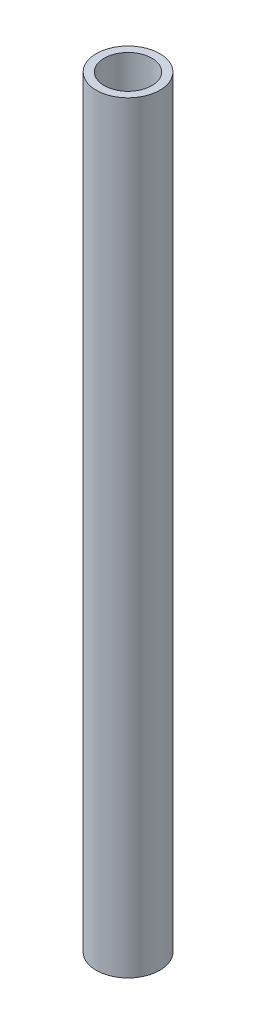
ISO-10303-21;
HEADER;
FILE_DESCRIPTION(('STEP AP214'),'2;1');
FILE_NAME('part.step','',(''),(''),'','','');
FILE_SCHEMA(('AUTOMOTIVE_DESIGN { 1 0 10303 214 1 1 1 1 }'));
ENDSEC;
DATA;
#1=APPLICATION_CONTEXT('core data for automotive mechanical design processes');
#2=APPLICATION_PROTOCOL_DEFINITION('international standard','automotive_design',2000,#1);
#3=PRODUCT_CONTEXT('',#1,'mechanical');
#4=PRODUCT('Part','Part','',(#3));
#5=PRODUCT_RELATED_PRODUCT_CATEGORY('part','',(#4));
#6=PRODUCT_DEFINITION_FORMATION('','',#4);
#7=PRODUCT_DEFINITION_CONTEXT('part definition',#1,'design');
#8=PRODUCT_DEFINITION('design','',#6,#7);
#9=PRODUCT_DEFINITION_SHAPE('','',#8);
#10=(LENGTH_UNIT() NAMED_UNIT(*) SI_UNIT(.MILLI.,.METRE.));
#11=(NAMED_UNIT(*) PLANE_ANGLE_UNIT() SI_UNIT($,.RADIAN.));
#12=(NAMED_UNIT(*) SI_UNIT($,.STERADIAN.) SOLID_ANGLE_UNIT());
#13=UNCERTAINTY_MEASURE_WITH_UNIT(LENGTH_MEASURE(1.E-05),#10,'distance_accuracy_value','');
#14=(GEOMETRIC_REPRESENTATION_CONTEXT(3) GLOBAL_UNCERTAINTY_ASSIGNED_CONTEXT((#13)) GLOBAL_UNIT_ASSIGNED_CONTEXT((#10,
#11,#12)) REPRESENTATION_CONTEXT('',''));
#15=CARTESIAN_POINT('',(0.,0.,0.));
#16=DIRECTION('',(0.,0.,1.));
#17=DIRECTION('',(1.,0.,0.));
#18=AXIS2_PLACEMENT_3D('',#15,#16,#17);
#19=CARTESIAN_POINT('',(0.,120.,0.));
#20=DIRECTION('',(0.,1.,0.));
#21=DIRECTION('',(0.,0.,-1.));
#22=AXIS2_PLACEMENT_3D('',#19,#20,#21);
#23=PLANE('',#22);
#24=CARTESIAN_POINT('',(0.,120.,0.));
#25=DIRECTION('',(0.,-1.,0.));
#26=DIRECTION('',(0.,0.,-1.));
#27=AXIS2_PLACEMENT_3D('',#24,#25,#26);
#28=CIRCLE('',#27,5.);
#29=CARTESIAN_POINT('',(0.,120.,-5.));
#30=VERTEX_POINT('',#29);
#31=EDGE_CURVE('E10',#30,#30,#28,.T.);
#32=ORIENTED_EDGE('',*,*,#31,.F.);
#33=EDGE_LOOP('',(#32));
#34=FACE_BOUND('',#33,.T.);
#35=CARTESIAN_POINT('',(0.,120.,0.));
#36=DIRECTION('',(0.,-1.,0.));
#37=DIRECTION('',(0.,0.,-1.));
#38=AXIS2_PLACEMENT_3D('',#35,#36,#37);
#39=CIRCLE('',#38,3.75);
#40=CARTESIAN_POINT('',(0.,120.,-3.75));
#41=VERTEX_POINT('',#40);
#42=EDGE_CURVE('E46',#41,#41,#39,.T.);
#43=ORIENTED_EDGE('',*,*,#42,.T.);
#44=EDGE_LOOP('',(#43));
#45=FACE_BOUND('',#44,.T.);
#46=ADVANCED_FACE('F35',(#34,#45),#23,.T.);
#47=CARTESIAN_POINT('',(0.,0.,0.));
#48=DIRECTION('',(0.,1.,0.));
#49=DIRECTION('',(0.,0.,-1.));
#50=AXIS2_PLACEMENT_3D('',#47,#48,#49);
#51=PLANE('',#50);
#52=CARTESIAN_POINT('',(0.,0.,0.));
#53=DIRECTION('',(0.,-1.,0.));
#54=DIRECTION('',(0.,0.,-1.));
#55=AXIS2_PLACEMENT_3D('',#52,#53,#54);
#56=CIRCLE('',#55,5.);
#57=CARTESIAN_POINT('',(0.,0.,-5.));
#58=VERTEX_POINT('',#57);
#59=EDGE_CURVE('E39',#58,#58,#56,.T.);
#60=ORIENTED_EDGE('',*,*,#59,.T.);
#61=EDGE_LOOP('',(#60));
#62=FACE_BOUND('',#61,.T.);
#63=CARTESIAN_POINT('',(0.,0.,0.));
#64=DIRECTION('',(0.,-1.,0.));
#65=DIRECTION('',(0.,0.,-1.));
#66=AXIS2_PLACEMENT_3D('',#63,#64,#65);
#67=CIRCLE('',#66,3.75);
#68=CARTESIAN_POINT('',(0.,0.,-3.75));
#69=VERTEX_POINT('',#68);
#70=EDGE_CURVE('E48',#69,#69,#67,.T.);
#71=ORIENTED_EDGE('',*,*,#70,.F.);
#72=EDGE_LOOP('',(#71));
#73=FACE_BOUND('',#72,.T.);
#74=ADVANCED_FACE('F61',(#62,#73),#51,.F.);
#75=CARTESIAN_POINT('',(0.,120.,0.));
#76=DIRECTION('',(0.,-1.,0.));
#77=DIRECTION('',(0.,0.,1.));
#78=AXIS2_PLACEMENT_3D('',#75,#76,#77);
#79=CYLINDRICAL_SURFACE('',#78,5.);
#80=ORIENTED_EDGE('',*,*,#31,.T.);
#81=EDGE_LOOP('',(#80));
#82=FACE_BOUND('',#81,.T.);
#83=ORIENTED_EDGE('',*,*,#59,.F.);
#84=EDGE_LOOP('',(#83));
#85=FACE_BOUND('',#84,.T.);
#86=ADVANCED_FACE('F37',(#82,#85),#79,.T.);
#87=CARTESIAN_POINT('',(0.,120.,0.));
#88=DIRECTION('',(0.,-1.,0.));
#89=DIRECTION('',(0.,0.,1.));
#90=AXIS2_PLACEMENT_3D('',#87,#88,#89);
#91=CYLINDRICAL_SURFACE('',#90,3.75);
#92=ORIENTED_EDGE('',*,*,#42,.F.);
#93=EDGE_LOOP('',(#92));
#94=FACE_BOUND('',#93,.T.);
#95=ORIENTED_EDGE('',*,*,#70,.T.);
#96=EDGE_LOOP('',(#95));
#97=FACE_BOUND('',#96,.T.);
#98=ADVANCED_FACE('F55',(#94,#97),#91,.F.);
#99=CLOSED_SHELL('',(#46,#74,#86,#98));
#100=MANIFOLD_SOLID_BREP('B2',#99);
#101=ADVANCED_BREP_SHAPE_REPRESENTATION('',(#18,#100),#14);
#102=SHAPE_DEFINITION_REPRESENTATION(#9,#101);
ENDSEC;
END-ISO-10303-21;
